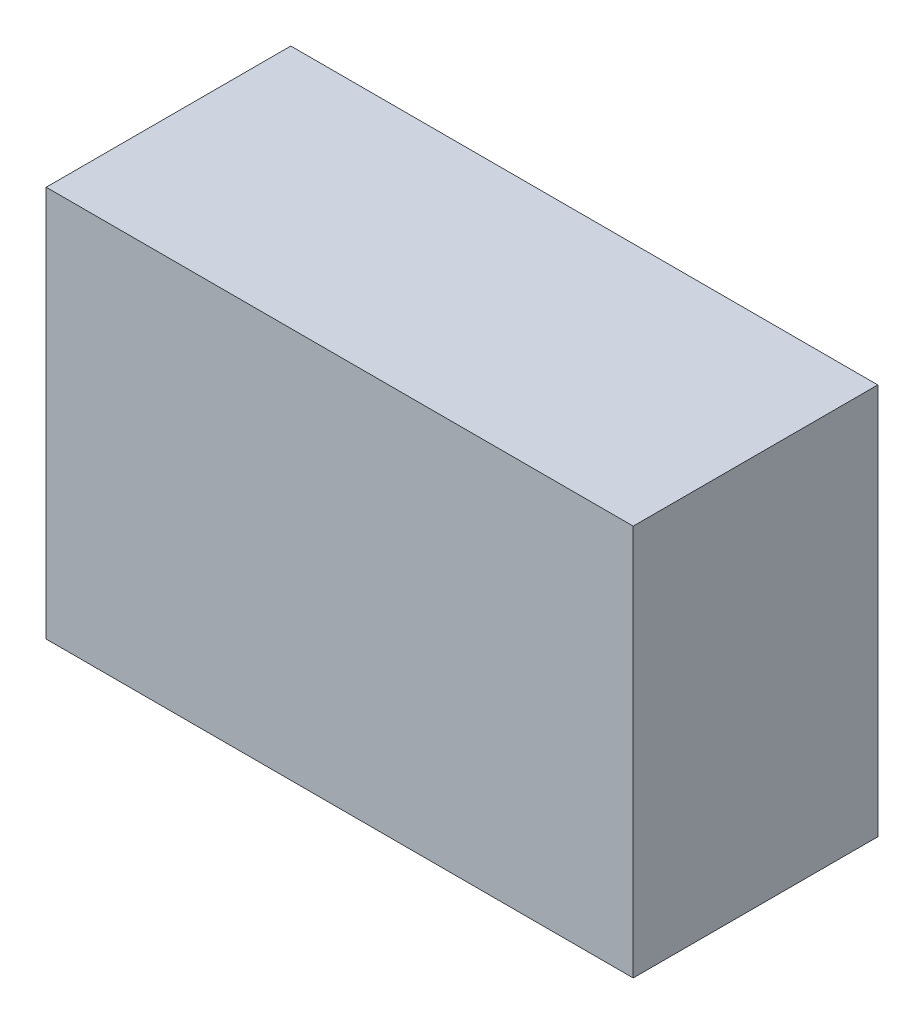
ISO-10303-21;
HEADER;
FILE_DESCRIPTION(('STEP AP214'),'2;1');
FILE_NAME('part.step','',(''),(''),'','','');
FILE_SCHEMA(('AUTOMOTIVE_DESIGN { 1 0 10303 214 1 1 1 1 }'));
ENDSEC;
DATA;
#1=APPLICATION_CONTEXT('core data for automotive mechanical design processes');
#2=APPLICATION_PROTOCOL_DEFINITION('international standard','automotive_design',2000,#1);
#3=PRODUCT_CONTEXT('',#1,'mechanical');
#4=PRODUCT('Part','Part','',(#3));
#5=PRODUCT_RELATED_PRODUCT_CATEGORY('part','',(#4));
#6=PRODUCT_DEFINITION_FORMATION('','',#4);
#7=PRODUCT_DEFINITION_CONTEXT('part definition',#1,'design');
#8=PRODUCT_DEFINITION('design','',#6,#7);
#9=PRODUCT_DEFINITION_SHAPE('','',#8);
#10=(LENGTH_UNIT() NAMED_UNIT(*) SI_UNIT(.MILLI.,.METRE.));
#11=(NAMED_UNIT(*) PLANE_ANGLE_UNIT() SI_UNIT($,.RADIAN.));
#12=(NAMED_UNIT(*) SI_UNIT($,.STERADIAN.) SOLID_ANGLE_UNIT());
#13=UNCERTAINTY_MEASURE_WITH_UNIT(LENGTH_MEASURE(1.E-05),#10,'distance_accuracy_value','');
#14=(GEOMETRIC_REPRESENTATION_CONTEXT(3) GLOBAL_UNCERTAINTY_ASSIGNED_CONTEXT((#13)) GLOBAL_UNIT_ASSIGNED_CONTEXT((#10,
#11,#12)) REPRESENTATION_CONTEXT('',''));
#15=CARTESIAN_POINT('',(0.,0.,0.));
#16=DIRECTION('',(0.,0.,1.));
#17=DIRECTION('',(1.,0.,0.));
#18=AXIS2_PLACEMENT_3D('',#15,#16,#17);
#19=CARTESIAN_POINT('',(-0.5999988,-0.3999992,0.499999));
#20=DIRECTION('',(0.,0.,-1.));
#21=DIRECTION('',(-1.,0.,0.));
#22=AXIS2_PLACEMENT_3D('',#19,#20,#21);
#23=PLANE('',#22);
#24=DIRECTION('',(0.,1.,0.));
#25=VECTOR('',#24,1.);
#26=CARTESIAN_POINT('',(0.60000134,-0.3999992,0.499999));
#27=LINE('',#26,#25);
#28=CARTESIAN_POINT('',(0.60000134,-0.3999992,0.499999));
#29=VERTEX_POINT('',#28);
#30=CARTESIAN_POINT('',(0.60000134,0.3999992,0.499999));
#31=VERTEX_POINT('',#30);
#32=EDGE_CURVE('E55',#29,#31,#27,.T.);
#33=ORIENTED_EDGE('',*,*,#32,.T.);
#34=DIRECTION('',(1.,0.,0.));
#35=VECTOR('',#34,1.);
#36=CARTESIAN_POINT('',(0.60000134,0.3999992,0.499999));
#37=LINE('',#36,#35);
#38=CARTESIAN_POINT('',(-0.5999988,0.3999992,0.499999));
#39=VERTEX_POINT('',#38);
#40=EDGE_CURVE('E57',#31,#39,#37,.F.);
#41=ORIENTED_EDGE('',*,*,#40,.T.);
#42=DIRECTION('',(0.,1.,0.));
#43=VECTOR('',#42,1.);
#44=CARTESIAN_POINT('',(-0.5999988,0.3999992,0.499999));
#45=LINE('',#44,#43);
#46=CARTESIAN_POINT('',(-0.5999988,-0.3999992,0.499999));
#47=VERTEX_POINT('',#46);
#48=EDGE_CURVE('E20',#39,#47,#45,.F.);
#49=ORIENTED_EDGE('',*,*,#48,.T.);
#50=DIRECTION('',(1.,0.,0.));
#51=VECTOR('',#50,1.);
#52=CARTESIAN_POINT('',(-0.5999988,-0.3999992,0.499999));
#53=LINE('',#52,#51);
#54=EDGE_CURVE('E80',#47,#29,#53,.T.);
#55=ORIENTED_EDGE('',*,*,#54,.T.);
#56=EDGE_LOOP('',(#33,#41,#49,#55));
#57=FACE_BOUND('',#56,.T.);
#58=ADVANCED_FACE('F17',(#57),#23,.F.);
#59=CARTESIAN_POINT('',(-0.5999988,0.3999992,0.));
#60=DIRECTION('',(1.,0.,0.));
#61=DIRECTION('',(0.,0.,-1.));
#62=AXIS2_PLACEMENT_3D('',#59,#60,#61);
#63=PLANE('',#62);
#64=DIRECTION('',(0.,0.,1.));
#65=VECTOR('',#64,1.);
#66=CARTESIAN_POINT('',(-0.5999988,-0.3999992,0.));
#67=LINE('',#66,#65);
#68=CARTESIAN_POINT('',(-0.5999988,-0.3999992,0.));
#69=VERTEX_POINT('',#68);
#70=EDGE_CURVE('E68',#69,#47,#67,.T.);
#71=ORIENTED_EDGE('',*,*,#70,.T.);
#72=ORIENTED_EDGE('',*,*,#48,.F.);
#73=DIRECTION('',(0.,0.,-1.));
#74=VECTOR('',#73,1.);
#75=CARTESIAN_POINT('',(-0.5999988,0.3999992,0.));
#76=LINE('',#75,#74);
#77=CARTESIAN_POINT('',(-0.5999988,0.3999992,0.));
#78=VERTEX_POINT('',#77);
#79=EDGE_CURVE('E63',#39,#78,#76,.T.);
#80=ORIENTED_EDGE('',*,*,#79,.T.);
#81=DIRECTION('',(0.,1.,0.));
#82=VECTOR('',#81,1.);
#83=CARTESIAN_POINT('',(-0.5999988,-0.3999992,0.));
#84=LINE('',#83,#82);
#85=EDGE_CURVE('E83',#69,#78,#84,.T.);
#86=ORIENTED_EDGE('',*,*,#85,.F.);
#87=EDGE_LOOP('',(#71,#72,#80,#86));
#88=FACE_BOUND('',#87,.T.);
#89=ADVANCED_FACE('F65',(#88),#63,.F.);
#90=CARTESIAN_POINT('',(0.60000134,0.3999992,0.));
#91=DIRECTION('',(0.,-1.,0.));
#92=DIRECTION('',(0.,0.,-1.));
#93=AXIS2_PLACEMENT_3D('',#90,#91,#92);
#94=PLANE('',#93);
#95=ORIENTED_EDGE('',*,*,#79,.F.);
#96=ORIENTED_EDGE('',*,*,#40,.F.);
#97=DIRECTION('',(0.,0.,1.));
#98=VECTOR('',#97,1.);
#99=CARTESIAN_POINT('',(0.60000134,0.3999992,0.));
#100=LINE('',#99,#98);
#101=CARTESIAN_POINT('',(0.60000134,0.3999992,0.));
#102=VERTEX_POINT('',#101);
#103=EDGE_CURVE('E75',#31,#102,#100,.F.);
#104=ORIENTED_EDGE('',*,*,#103,.T.);
#105=DIRECTION('',(-1.,0.,0.));
#106=VECTOR('',#105,1.);
#107=CARTESIAN_POINT('',(-0.5999988,0.3999992,0.));
#108=LINE('',#107,#106);
#109=EDGE_CURVE('E72',#78,#102,#108,.F.);
#110=ORIENTED_EDGE('',*,*,#109,.F.);
#111=EDGE_LOOP('',(#95,#96,#104,#110));
#112=FACE_BOUND('',#111,.T.);
#113=ADVANCED_FACE('F70',(#112),#94,.F.);
#114=CARTESIAN_POINT('',(0.60000134,-0.3999992,0.));
#115=DIRECTION('',(-1.,0.,0.));
#116=DIRECTION('',(0.,0.,1.));
#117=AXIS2_PLACEMENT_3D('',#114,#115,#116);
#118=PLANE('',#117);
#119=ORIENTED_EDGE('',*,*,#103,.F.);
#120=ORIENTED_EDGE('',*,*,#32,.F.);
#121=DIRECTION('',(0.,0.,1.));
#122=VECTOR('',#121,1.);
#123=CARTESIAN_POINT('',(0.60000134,-0.3999992,0.));
#124=LINE('',#123,#122);
#125=CARTESIAN_POINT('',(0.60000134,-0.3999992,0.));
#126=VERTEX_POINT('',#125);
#127=EDGE_CURVE('E35',#29,#126,#124,.F.);
#128=ORIENTED_EDGE('',*,*,#127,.T.);
#129=DIRECTION('',(0.,1.,0.));
#130=VECTOR('',#129,1.);
#131=CARTESIAN_POINT('',(0.60000134,-0.3999992,0.));
#132=LINE('',#131,#130);
#133=EDGE_CURVE('E26',#102,#126,#132,.F.);
#134=ORIENTED_EDGE('',*,*,#133,.F.);
#135=EDGE_LOOP('',(#119,#120,#128,#134));
#136=FACE_BOUND('',#135,.T.);
#137=ADVANCED_FACE('F89',(#136),#118,.F.);
#138=CARTESIAN_POINT('',(-0.5999988,-0.3999992,0.));
#139=DIRECTION('',(0.,1.,0.));
#140=DIRECTION('',(0.,0.,1.));
#141=AXIS2_PLACEMENT_3D('',#138,#139,#140);
#142=PLANE('',#141);
#143=ORIENTED_EDGE('',*,*,#127,.F.);
#144=ORIENTED_EDGE('',*,*,#54,.F.);
#145=ORIENTED_EDGE('',*,*,#70,.F.);
#146=DIRECTION('',(-1.,0.,0.));
#147=VECTOR('',#146,1.);
#148=CARTESIAN_POINT('',(-0.5999988,-0.3999992,0.));
#149=LINE('',#148,#147);
#150=EDGE_CURVE('E11',#126,#69,#149,.T.);
#151=ORIENTED_EDGE('',*,*,#150,.F.);
#152=EDGE_LOOP('',(#143,#144,#145,#151));
#153=FACE_BOUND('',#152,.T.);
#154=ADVANCED_FACE('F91',(#153),#142,.F.);
#155=CARTESIAN_POINT('',(-0.5999988,-0.3999992,0.));
#156=DIRECTION('',(0.,0.,-1.));
#157=DIRECTION('',(-1.,0.,0.));
#158=AXIS2_PLACEMENT_3D('',#155,#156,#157);
#159=PLANE('',#158);
#160=ORIENTED_EDGE('',*,*,#133,.T.);
#161=ORIENTED_EDGE('',*,*,#150,.T.);
#162=ORIENTED_EDGE('',*,*,#85,.T.);
#163=ORIENTED_EDGE('',*,*,#109,.T.);
#164=EDGE_LOOP('',(#160,#161,#162,#163));
#165=FACE_BOUND('',#164,.T.);
#166=ADVANCED_FACE('F88',(#165),#159,.T.);
#167=CLOSED_SHELL('',(#58,#89,#113,#137,#154,#166));
#168=MANIFOLD_SOLID_BREP('B1',#167);
#169=ADVANCED_BREP_SHAPE_REPRESENTATION('',(#18,#168),#14);
#170=SHAPE_DEFINITION_REPRESENTATION(#9,#169);
ENDSEC;
END-ISO-10303-21;
